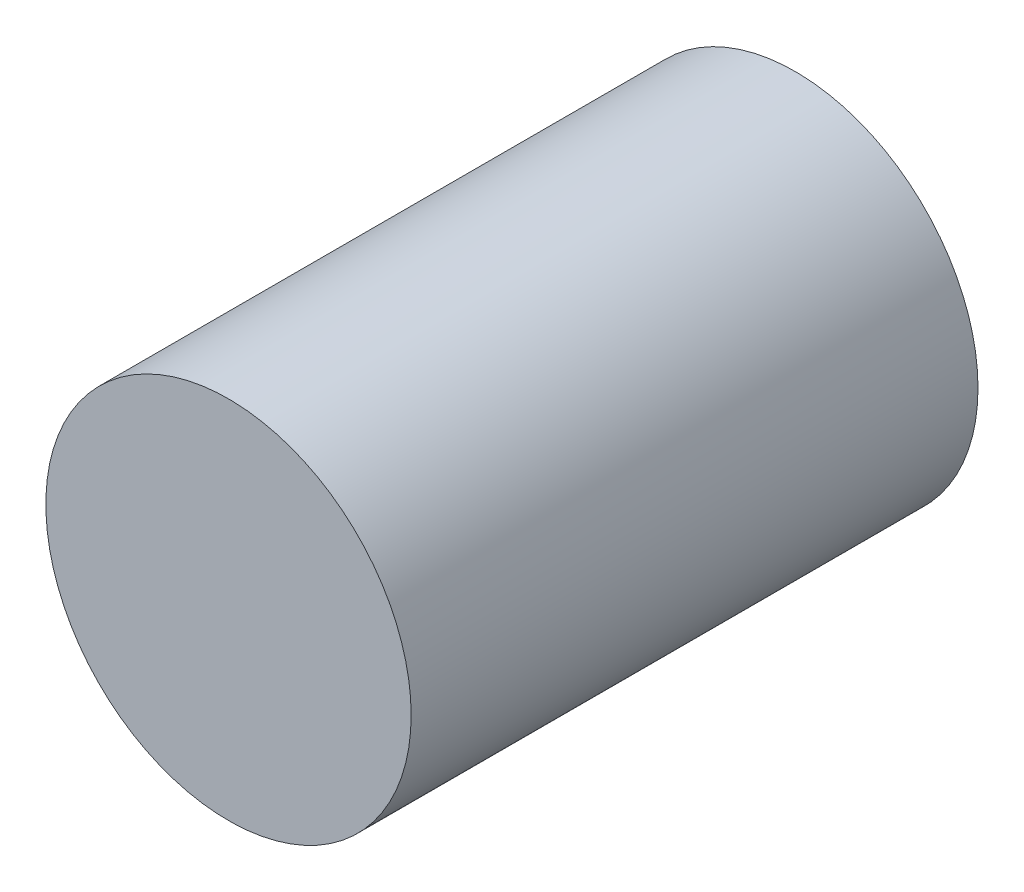
ISO-10303-21;
HEADER;
FILE_DESCRIPTION(('STEP AP214'),'2;1');
FILE_NAME('part.step','',(''),(''),'','','');
FILE_SCHEMA(('AUTOMOTIVE_DESIGN { 1 0 10303 214 1 1 1 1 }'));
ENDSEC;
DATA;
#1=APPLICATION_CONTEXT('core data for automotive mechanical design processes');
#2=APPLICATION_PROTOCOL_DEFINITION('international standard','automotive_design',2000,#1);
#3=PRODUCT_CONTEXT('',#1,'mechanical');
#4=PRODUCT('Part','Part','',(#3));
#5=PRODUCT_RELATED_PRODUCT_CATEGORY('part','',(#4));
#6=PRODUCT_DEFINITION_FORMATION('','',#4);
#7=PRODUCT_DEFINITION_CONTEXT('part definition',#1,'design');
#8=PRODUCT_DEFINITION('design','',#6,#7);
#9=PRODUCT_DEFINITION_SHAPE('','',#8);
#10=(LENGTH_UNIT() NAMED_UNIT(*) SI_UNIT(.MILLI.,.METRE.));
#11=(NAMED_UNIT(*) PLANE_ANGLE_UNIT() SI_UNIT($,.RADIAN.));
#12=(NAMED_UNIT(*) SI_UNIT($,.STERADIAN.) SOLID_ANGLE_UNIT());
#13=UNCERTAINTY_MEASURE_WITH_UNIT(LENGTH_MEASURE(1.E-05),#10,'distance_accuracy_value','');
#14=(GEOMETRIC_REPRESENTATION_CONTEXT(3) GLOBAL_UNCERTAINTY_ASSIGNED_CONTEXT((#13)) GLOBAL_UNIT_ASSIGNED_CONTEXT((#10,
#11,#12)) REPRESENTATION_CONTEXT('',''));
#15=CARTESIAN_POINT('',(0.,0.,0.));
#16=DIRECTION('',(0.,0.,1.));
#17=DIRECTION('',(1.,0.,0.));
#18=AXIS2_PLACEMENT_3D('',#15,#16,#17);
#19=CARTESIAN_POINT('',(0.,0.,-18.));
#20=DIRECTION('',(0.,0.,1.));
#21=DIRECTION('',(1.,0.,0.));
#22=AXIS2_PLACEMENT_3D('',#19,#20,#21);
#23=CYLINDRICAL_SURFACE('',#22,5.8);
#24=CARTESIAN_POINT('',(0.,0.,-18.));
#25=DIRECTION('',(0.,0.,1.));
#26=DIRECTION('',(1.,0.,0.));
#27=AXIS2_PLACEMENT_3D('',#24,#25,#26);
#28=CIRCLE('',#27,5.8);
#29=CARTESIAN_POINT('',(5.8,0.,-18.));
#30=VERTEX_POINT('',#29);
#31=EDGE_CURVE('E10',#30,#30,#28,.T.);
#32=ORIENTED_EDGE('',*,*,#31,.T.);
#33=EDGE_LOOP('',(#32));
#34=FACE_BOUND('',#33,.T.);
#35=CARTESIAN_POINT('',(0.,0.,0.));
#36=DIRECTION('',(0.,0.,1.));
#37=DIRECTION('',(1.,0.,0.));
#38=AXIS2_PLACEMENT_3D('',#35,#36,#37);
#39=CIRCLE('',#38,5.8);
#40=CARTESIAN_POINT('',(5.8,0.,0.));
#41=VERTEX_POINT('',#40);
#42=EDGE_CURVE('E39',#41,#41,#39,.T.);
#43=ORIENTED_EDGE('',*,*,#42,.F.);
#44=EDGE_LOOP('',(#43));
#45=FACE_BOUND('',#44,.T.);
#46=ADVANCED_FACE('F36',(#34,#45),#23,.T.);
#47=CARTESIAN_POINT('',(0.,0.,-18.));
#48=DIRECTION('',(0.,0.,1.));
#49=DIRECTION('',(1.,0.,0.));
#50=AXIS2_PLACEMENT_3D('',#47,#48,#49);
#51=PLANE('',#50);
#52=CARTESIAN_POINT('',(0.,0.,-18.));
#53=DIRECTION('',(0.,0.,-1.));
#54=DIRECTION('',(-1.,0.,0.));
#55=AXIS2_PLACEMENT_3D('',#52,#53,#54);
#56=CIRCLE('',#55,4.);
#57=CARTESIAN_POINT('',(-4.,0.,-18.));
#58=VERTEX_POINT('',#57);
#59=EDGE_CURVE('E48',#58,#58,#56,.T.);
#60=ORIENTED_EDGE('',*,*,#59,.F.);
#61=EDGE_LOOP('',(#60));
#62=FACE_BOUND('',#61,.T.);
#63=ORIENTED_EDGE('',*,*,#31,.F.);
#64=EDGE_LOOP('',(#63));
#65=FACE_BOUND('',#64,.T.);
#66=ADVANCED_FACE('F63',(#62,#65),#51,.F.);
#67=CARTESIAN_POINT('',(0.,0.,0.));
#68=DIRECTION('',(0.,0.,1.));
#69=DIRECTION('',(1.,0.,0.));
#70=AXIS2_PLACEMENT_3D('',#67,#68,#69);
#71=PLANE('',#70);
#72=ORIENTED_EDGE('',*,*,#42,.T.);
#73=EDGE_LOOP('',(#72));
#74=FACE_BOUND('',#73,.T.);
#75=ADVANCED_FACE('F59',(#74),#71,.T.);
#76=CARTESIAN_POINT('',(0.,0.,-6.));
#77=DIRECTION('',(0.,0.,-1.));
#78=DIRECTION('',(-1.,0.,0.));
#79=AXIS2_PLACEMENT_3D('',#76,#77,#78);
#80=CYLINDRICAL_SURFACE('',#79,4.);
#81=CARTESIAN_POINT('',(0.,0.,-6.));
#82=DIRECTION('',(0.,0.,-1.));
#83=DIRECTION('',(-1.,0.,0.));
#84=AXIS2_PLACEMENT_3D('',#81,#82,#83);
#85=CIRCLE('',#84,4.);
#86=CARTESIAN_POINT('',(-4.,0.,-6.));
#87=VERTEX_POINT('',#86);
#88=EDGE_CURVE('E46',#87,#87,#85,.T.);
#89=ORIENTED_EDGE('',*,*,#88,.F.);
#90=EDGE_LOOP('',(#89));
#91=FACE_BOUND('',#90,.T.);
#92=ORIENTED_EDGE('',*,*,#59,.T.);
#93=EDGE_LOOP('',(#92));
#94=FACE_BOUND('',#93,.T.);
#95=ADVANCED_FACE('F56',(#91,#94),#80,.F.);
#96=CARTESIAN_POINT('',(0.,0.,-6.));
#97=DIRECTION('',(0.,0.,-1.));
#98=DIRECTION('',(-1.,0.,0.));
#99=AXIS2_PLACEMENT_3D('',#96,#97,#98);
#100=PLANE('',#99);
#101=ORIENTED_EDGE('',*,*,#88,.T.);
#102=EDGE_LOOP('',(#101));
#103=FACE_BOUND('',#102,.T.);
#104=ADVANCED_FACE('F54',(#103),#100,.T.);
#105=CLOSED_SHELL('',(#46,#66,#75,#95,#104));
#106=MANIFOLD_SOLID_BREP('B2',#105);
#107=ADVANCED_BREP_SHAPE_REPRESENTATION('',(#18,#106),#14);
#108=SHAPE_DEFINITION_REPRESENTATION(#9,#107);
ENDSEC;
END-ISO-10303-21;
